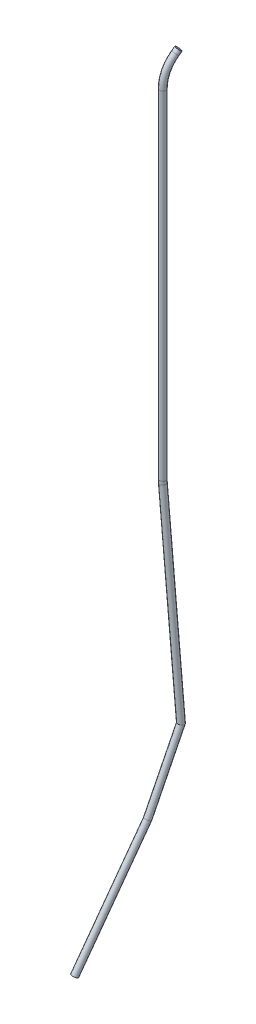
ISO-10303-21;
HEADER;
FILE_DESCRIPTION(('STEP AP214'),'2;1');
FILE_NAME('part.step','',(''),(''),'','','');
FILE_SCHEMA(('AUTOMOTIVE_DESIGN { 1 0 10303 214 1 1 1 1 }'));
ENDSEC;
DATA;
#1=APPLICATION_CONTEXT('core data for automotive mechanical design processes');
#2=APPLICATION_PROTOCOL_DEFINITION('international standard','automotive_design',2000,#1);
#3=PRODUCT_CONTEXT('',#1,'mechanical');
#4=PRODUCT('Part','Part','',(#3));
#5=PRODUCT_RELATED_PRODUCT_CATEGORY('part','',(#4));
#6=PRODUCT_DEFINITION_FORMATION('','',#4);
#7=PRODUCT_DEFINITION_CONTEXT('part definition',#1,'design');
#8=PRODUCT_DEFINITION('design','',#6,#7);
#9=PRODUCT_DEFINITION_SHAPE('','',#8);
#10=(LENGTH_UNIT() NAMED_UNIT(*) SI_UNIT(.MILLI.,.METRE.));
#11=(NAMED_UNIT(*) PLANE_ANGLE_UNIT() SI_UNIT($,.RADIAN.));
#12=(NAMED_UNIT(*) SI_UNIT($,.STERADIAN.) SOLID_ANGLE_UNIT());
#13=UNCERTAINTY_MEASURE_WITH_UNIT(LENGTH_MEASURE(1.E-05),#10,'distance_accuracy_value','');
#14=(GEOMETRIC_REPRESENTATION_CONTEXT(3) GLOBAL_UNCERTAINTY_ASSIGNED_CONTEXT((#13)) GLOBAL_UNIT_ASSIGNED_CONTEXT((#10,
#11,#12)) REPRESENTATION_CONTEXT('',''));
#15=CARTESIAN_POINT('',(0.,0.,0.));
#16=DIRECTION('',(0.,0.,1.));
#17=DIRECTION('',(1.,0.,0.));
#18=AXIS2_PLACEMENT_3D('',#15,#16,#17);
#19=CARTESIAN_POINT('',(1458.48486223035,139.358663740261,122.551988760833));
#20=DIRECTION('',(0.185989729388851,0.754693486988978,-0.629162587300198));
#21=DIRECTION('',(0.,0.640335358096755,0.768095455767771));
#22=AXIS2_PLACEMENT_3D('',#19,#20,#21);
#23=PLANE('',#22);
#24=CARTESIAN_POINT('',(1458.48486223035,139.358663740261,122.551988760833));
#25=DIRECTION('',(0.185989729388851,0.754693486988978,-0.629162587300198));
#26=DIRECTION('',(0.,0.640335358096755,0.768095455767771));
#27=AXIS2_PLACEMENT_3D('',#24,#25,#26);
#28=CIRCLE('',#27,3.00000000000008);
#29=CARTESIAN_POINT('',(1458.48486223035,141.279669814551,124.856275128136));
#30=VERTEX_POINT('',#29);
#31=EDGE_CURVE('E49',#30,#30,#28,.T.);
#32=ORIENTED_EDGE('',*,*,#31,.T.);
#33=EDGE_LOOP('',(#32));
#34=FACE_BOUND('',#33,.T.);
#35=ADVANCED_FACE('F32',(#34),#23,.T.);
#36=CARTESIAN_POINT('',(1452.70231911313,-585.11980405732,216.161631665417));
#37=DIRECTION('',(0.107062231172596,0.88083562059339,-0.461157552415877));
#38=DIRECTION('',(-0.0591812651069512,0.468646817382516,0.881401008858952));
#39=AXIS2_PLACEMENT_3D('',#36,#37,#38);
#40=PLANE('',#39);
#41=CARTESIAN_POINT('',(1452.70231911313,-585.11980405732,216.161631665417));
#42=DIRECTION('',(0.107062231172596,0.88083562059339,-0.461157552415877));
#43=DIRECTION('',(-0.0591812651069512,0.468646817382516,0.881401008858952));
#44=AXIS2_PLACEMENT_3D('',#41,#42,#43);
#45=CIRCLE('',#44,3.00000000000008);
#46=CARTESIAN_POINT('',(1452.52477531781,-583.713863605172,218.805834691994));
#47=VERTEX_POINT('',#46);
#48=EDGE_CURVE('E39',#47,#47,#45,.T.);
#49=ORIENTED_EDGE('',*,*,#48,.F.);
#50=EDGE_LOOP('',(#49));
#51=FACE_BOUND('',#50,.T.);
#52=ADVANCED_FACE('F68',(#51),#40,.F.);
#53=CARTESIAN_POINT('',(1471.28057453525,-409.090647204637,132.909066645072));
#54=DIRECTION('',(-0.0832224921037457,0.996509290299467,0.00657656102344812));
#55=DIRECTION('',(-0.996530841087376,-0.0832242918965766,0.));
#56=AXIS2_PLACEMENT_3D('',#53,#54,#55);
#57=CYLINDRICAL_SURFACE('',#56,3.00000000000008);
#58=CARTESIAN_POINT('',(1471.18330473774,-407.925934944442,132.91675327813));
#59=DIRECTION('',(-0.00582269901777962,0.983713185641717,-0.179650952045272));
#60=DIRECTION('',(0.385582629068258,-0.163552817310982,-0.908061953894365));
#61=AXIS2_PLACEMENT_3D('',#58,#59,#60);
#62=ELLIPSE('',#61,3.06252943184927,3.00000000000008);
#63=CARTESIAN_POINT('',(1472.36416288768,-408.426820261119,130.135786818386));
#64=VERTEX_POINT('',#63);
#65=EDGE_CURVE('E44',#64,#64,#62,.F.);
#66=ORIENTED_EDGE('',*,*,#65,.F.);
#67=EDGE_LOOP('',(#66));
#68=FACE_BOUND('',#67,.T.);
#69=CARTESIAN_POINT('',(1455.18305224235,-216.338302133385,134.181154694941));
#70=DIRECTION('',(-0.0832224921038035,0.996509290299462,0.00657656102343029));
#71=DIRECTION('',(-0.0673637499680086,-0.0122099313676358,0.99765376898313));
#72=AXIS2_PLACEMENT_3D('',#69,#70,#71);
#73=CIRCLE('',#72,3.00000000000008);
#74=CARTESIAN_POINT('',(1452.20281533239,-216.588747954116,134.416664464083));
#75=VERTEX_POINT('',#74);
#76=EDGE_CURVE('E35',#75,#75,#73,.T.);
#77=ORIENTED_EDGE('',*,*,#76,.F.);
#78=EDGE_LOOP('',(#77));
#79=FACE_BOUND('',#78,.T.);
#80=ADVANCED_FACE('F66',(#68,#79),#57,.T.);
#81=CARTESIAN_POINT('',(1494.91954437522,-212.999024523637,131.041024439724));
#82=DIRECTION('',(-0.0787782483762269,0.,-0.996892164470548));
#83=DIRECTION('',(-0.996892164470548,0.,0.0787782483762269));
#84=AXIS2_PLACEMENT_3D('',#81,#82,#83);
#85=TOROIDAL_SURFACE('',#84,39.9999999999993,3.00000000000008);
#86=CARTESIAN_POINT('',(1455.0438577964,-212.999024523636,134.192154374773));
#87=DIRECTION('',(0.,1.,0.));
#88=DIRECTION('',(-0.0678727087400846,0.,0.997693988860454));
#89=AXIS2_PLACEMENT_3D('',#86,#87,#88);
#90=CIRCLE('',#89,3.00000000000008);
#91=CARTESIAN_POINT('',(1452.05318130299,-212.999024523636,134.428489119902));
#92=VERTEX_POINT('',#91);
#93=EDGE_CURVE('E57',#92,#92,#90,.T.);
#94=CARTESIAN_POINT('',(1494.91954437522,-212.999024523637,131.041024439724));
#95=DIRECTION('',(-0.0787782483762269,0.,-0.996892164470548));
#96=DIRECTION('',(-0.996892164470548,0.,0.0787782483762269));
#97=AXIS2_PLACEMENT_3D('',#94,#95,#96);
#98=CIRCLE('',#97,42.9999999999994);
#99=EDGE_CURVE('',#75,#92,#98,.T.);
#100=ORIENTED_EDGE('',*,*,#76,.T.);
#101=ORIENTED_EDGE('',*,*,#93,.F.);
#102=ORIENTED_EDGE('',*,*,#99,.T.);
#103=ORIENTED_EDGE('',*,*,#99,.F.);
#104=EDGE_LOOP('',(#100,#102,#101,#103));
#105=FACE_BOUND('',#104,.T.);
#106=ADVANCED_FACE('F64',(#105),#85,.T.);
#107=CARTESIAN_POINT('',(1455.0438577964,-212.999024523636,134.192154374773));
#108=DIRECTION('',(0.,1.,0.));
#109=DIRECTION('',(0.,0.,1.));
#110=AXIS2_PLACEMENT_3D('',#107,#108,#109);
#111=CYLINDRICAL_SURFACE('',#110,3.00000000000008);
#112=CARTESIAN_POINT('',(1455.0438577964,110.440098889026,134.192154374773));
#113=DIRECTION('',(0.,1.,0.));
#114=DIRECTION('',(-0.0678727087400846,0.,0.997693988860454));
#115=AXIS2_PLACEMENT_3D('',#112,#113,#114);
#116=CIRCLE('',#115,3.00000000000008);
#117=CARTESIAN_POINT('',(1454.19339553741,110.440098889026,137.069082240751));
#118=VERTEX_POINT('',#117);
#119=EDGE_CURVE('E55',#118,#118,#116,.T.);
#120=ORIENTED_EDGE('',*,*,#119,.F.);
#121=EDGE_LOOP('',(#120));
#122=FACE_BOUND('',#121,.T.);
#123=ORIENTED_EDGE('',*,*,#93,.T.);
#124=EDGE_LOOP('',(#123));
#125=FACE_BOUND('',#124,.T.);
#126=ADVANCED_FACE('F75',(#122,#125),#111,.T.);
#127=CARTESIAN_POINT('',(1466.38335458287,110.440098889026,95.8331161617321));
#128=DIRECTION('',(-0.95897595532603,0.,-0.28348741966184));
#129=DIRECTION('',(-0.28348741966184,0.,0.95897595532603));
#130=AXIS2_PLACEMENT_3D('',#127,#128,#129);
#131=TOROIDAL_SURFACE('',#130,40.,3.00000000000008);
#132=CARTESIAN_POINT('',(1457.82551021239,136.683200556143,124.782432468339));
#133=DIRECTION('',(0.185989729388851,0.754693486988978,-0.629162587300198));
#134=DIRECTION('',(0.,0.640335358096755,0.768095455767771));
#135=AXIS2_PLACEMENT_3D('',#132,#133,#134);
#136=CIRCLE('',#135,3.00000000000008);
#137=CARTESIAN_POINT('',(1457.1836718846,138.651433181177,126.953631191334));
#138=VERTEX_POINT('',#137);
#139=EDGE_CURVE('E52',#138,#138,#136,.T.);
#140=CARTESIAN_POINT('',(1466.38335458287,110.440098889026,95.8331161617321));
#141=DIRECTION('',(-0.95897595532603,0.,-0.28348741966184));
#142=DIRECTION('',(-0.28348741966184,0.,0.95897595532603));
#143=AXIS2_PLACEMENT_3D('',#140,#141,#142);
#144=CIRCLE('',#143,43.);
#145=EDGE_CURVE('',#118,#138,#144,.T.);
#146=ORIENTED_EDGE('',*,*,#119,.T.);
#147=ORIENTED_EDGE('',*,*,#139,.F.);
#148=ORIENTED_EDGE('',*,*,#145,.T.);
#149=ORIENTED_EDGE('',*,*,#145,.F.);
#150=EDGE_LOOP('',(#146,#148,#147,#149));
#151=FACE_BOUND('',#150,.T.);
#152=ADVANCED_FACE('F94',(#151),#131,.T.);
#153=CARTESIAN_POINT('',(1457.82551021239,136.683200556212,124.782432468275));
#154=DIRECTION('',(0.185989729388909,0.754693486988978,-0.62916258730018));
#155=DIRECTION('',(0.,0.640335358096744,0.76809545576778));
#156=AXIS2_PLACEMENT_3D('',#153,#154,#155);
#157=CYLINDRICAL_SURFACE('',#156,3.00000000000008);
#158=ORIENTED_EDGE('',*,*,#31,.F.);
#159=EDGE_LOOP('',(#158));
#160=FACE_BOUND('',#159,.T.);
#161=ORIENTED_EDGE('',*,*,#139,.T.);
#162=EDGE_LOOP('',(#161));
#163=FACE_BOUND('',#162,.T.);
#164=ADVANCED_FACE('F88',(#160,#163),#157,.T.);
#165=CARTESIAN_POINT('',(1465.84310699075,-477.136857280135,159.578187089805));
#166=DIRECTION('',(0.0718148648844433,0.930747000682997,-0.35854239066146));
#167=DIRECTION('',(0.,0.359470551110385,0.933156430018245));
#168=AXIS2_PLACEMENT_3D('',#165,#166,#167);
#169=CYLINDRICAL_SURFACE('',#168,3.00000000000008);
#170=CARTESIAN_POINT('',(1465.87069333795,-476.779328097891,159.44045968629));
#171=DIRECTION('',(0.0895984379206393,0.907410599838511,-0.410582663081256));
#172=DIRECTION('',(0.295131272584532,-0.417915171359111,-0.859211523136486));
#173=AXIS2_PLACEMENT_3D('',#170,#171,#172);
#174=ELLIPSE('',#173,3.00536312011824,3.00000000000008);
#175=CARTESIAN_POINT('',(1466.75766998017,-478.035314941232,156.858217062275));
#176=VERTEX_POINT('',#175);
#177=EDGE_CURVE('E10',#176,#176,#174,.F.);
#178=ORIENTED_EDGE('',*,*,#177,.F.);
#179=EDGE_LOOP('',(#178));
#180=FACE_BOUND('',#179,.T.);
#181=ORIENTED_EDGE('',*,*,#65,.T.);
#182=EDGE_LOOP('',(#181));
#183=FACE_BOUND('',#182,.T.);
#184=ADVANCED_FACE('F82',(#180,#183),#169,.T.);
#185=CARTESIAN_POINT('',(1452.70231911313,-585.11980405732,216.161631665417));
#186=DIRECTION('',(0.107062231172654,0.880835620593393,-0.461157552415858));
#187=DIRECTION('',(0.,0.463823460583459,0.885927647955737));
#188=AXIS2_PLACEMENT_3D('',#185,#186,#187);
#189=CYLINDRICAL_SURFACE('',#188,3.00000000000008);
#190=ORIENTED_EDGE('',*,*,#48,.T.);
#191=EDGE_LOOP('',(#190));
#192=FACE_BOUND('',#191,.T.);
#193=ORIENTED_EDGE('',*,*,#177,.T.);
#194=EDGE_LOOP('',(#193));
#195=FACE_BOUND('',#194,.T.);
#196=ADVANCED_FACE('F80',(#192,#195),#189,.T.);
#197=CLOSED_SHELL('',(#35,#52,#80,#106,#126,#152,#164,#184,#196));
#198=MANIFOLD_SOLID_BREP('B2',#197);
#199=ADVANCED_BREP_SHAPE_REPRESENTATION('',(#18,#198),#14);
#200=SHAPE_DEFINITION_REPRESENTATION(#9,#199);
ENDSEC;
END-ISO-10303-21;
